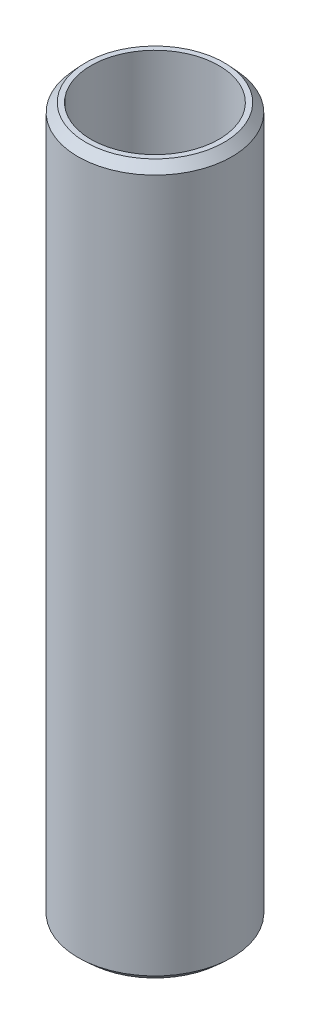
ISO-10303-21;
HEADER;
FILE_DESCRIPTION(('STEP AP214'),'2;1');
FILE_NAME('part.step','',(''),(''),'','','');
FILE_SCHEMA(('AUTOMOTIVE_DESIGN { 1 0 10303 214 1 1 1 1 }'));
ENDSEC;
DATA;
#1=APPLICATION_CONTEXT('core data for automotive mechanical design processes');
#2=APPLICATION_PROTOCOL_DEFINITION('international standard','automotive_design',2000,#1);
#3=PRODUCT_CONTEXT('',#1,'mechanical');
#4=PRODUCT('Part','Part','',(#3));
#5=PRODUCT_RELATED_PRODUCT_CATEGORY('part','',(#4));
#6=PRODUCT_DEFINITION_FORMATION('','',#4);
#7=PRODUCT_DEFINITION_CONTEXT('part definition',#1,'design');
#8=PRODUCT_DEFINITION('design','',#6,#7);
#9=PRODUCT_DEFINITION_SHAPE('','',#8);
#10=(LENGTH_UNIT() NAMED_UNIT(*) SI_UNIT(.MILLI.,.METRE.));
#11=(NAMED_UNIT(*) PLANE_ANGLE_UNIT() SI_UNIT($,.RADIAN.));
#12=(NAMED_UNIT(*) SI_UNIT($,.STERADIAN.) SOLID_ANGLE_UNIT());
#13=UNCERTAINTY_MEASURE_WITH_UNIT(LENGTH_MEASURE(1.E-05),#10,'distance_accuracy_value','');
#14=(GEOMETRIC_REPRESENTATION_CONTEXT(3) GLOBAL_UNCERTAINTY_ASSIGNED_CONTEXT((#13)) GLOBAL_UNIT_ASSIGNED_CONTEXT((#10,
#11,#12)) REPRESENTATION_CONTEXT('',''));
#15=CARTESIAN_POINT('',(0.,0.,0.));
#16=DIRECTION('',(0.,0.,1.));
#17=DIRECTION('',(1.,0.,0.));
#18=AXIS2_PLACEMENT_3D('',#15,#16,#17);
#19=CARTESIAN_POINT('',(0.,322.770922307598,0.));
#20=DIRECTION('',(0.,-1.,0.));
#21=DIRECTION('',(0.,0.,-1.));
#22=AXIS2_PLACEMENT_3D('',#19,#20,#21);
#23=CYLINDRICAL_SURFACE('',#22,35.);
#24=CARTESIAN_POINT('',(0.,318.893009212651,0.));
#25=DIRECTION('',(0.,1.,0.));
#26=DIRECTION('',(0.,0.,1.));
#27=AXIS2_PLACEMENT_3D('',#24,#25,#26);
#28=CIRCLE('',#27,35.);
#29=CARTESIAN_POINT('',(0.,318.893009212651,35.));
#30=VERTEX_POINT('',#29);
#31=EDGE_CURVE('E50',#30,#30,#28,.F.);
#32=ORIENTED_EDGE('',*,*,#31,.T.);
#33=EDGE_LOOP('',(#32));
#34=FACE_BOUND('',#33,.T.);
#35=CARTESIAN_POINT('',(0.,3.55687947888261,0.));
#36=DIRECTION('',(0.,1.,0.));
#37=DIRECTION('',(0.,0.,1.));
#38=AXIS2_PLACEMENT_3D('',#35,#36,#37);
#39=CIRCLE('',#38,35.);
#40=CARTESIAN_POINT('',(0.,3.55687947888261,35.));
#41=VERTEX_POINT('',#40);
#42=EDGE_CURVE('E51',#41,#41,#39,.T.);
#43=ORIENTED_EDGE('',*,*,#42,.T.);
#44=EDGE_LOOP('',(#43));
#45=FACE_BOUND('',#44,.T.);
#46=ADVANCED_FACE('F39',(#34,#45),#23,.T.);
#47=CARTESIAN_POINT('',(0.,322.770922307598,0.));
#48=DIRECTION('',(0.,1.,0.));
#49=DIRECTION('',(0.,0.,1.));
#50=AXIS2_PLACEMENT_3D('',#47,#48,#49);
#51=PLANE('',#50);
#52=CARTESIAN_POINT('',(0.,322.770922307598,0.));
#53=DIRECTION('',(0.,1.,0.));
#54=DIRECTION('',(0.,0.,1.));
#55=AXIS2_PLACEMENT_3D('',#52,#53,#54);
#56=CIRCLE('',#55,31.4431205211175);
#57=CARTESIAN_POINT('',(0.,322.770922307598,31.4431205211175));
#58=VERTEX_POINT('',#57);
#59=EDGE_CURVE('E54',#58,#58,#56,.T.);
#60=ORIENTED_EDGE('',*,*,#59,.T.);
#61=EDGE_LOOP('',(#60));
#62=FACE_BOUND('',#61,.T.);
#63=CARTESIAN_POINT('',(0.,322.770922307598,0.));
#64=DIRECTION('',(0.,1.,0.));
#65=DIRECTION('',(0.,0.,1.));
#66=AXIS2_PLACEMENT_3D('',#63,#64,#65);
#67=CIRCLE('',#66,29.0846264385908);
#68=CARTESIAN_POINT('',(0.,322.770922307598,29.0846264385908));
#69=VERTEX_POINT('',#68);
#70=EDGE_CURVE('E58',#69,#69,#67,.T.);
#71=ORIENTED_EDGE('',*,*,#70,.F.);
#72=EDGE_LOOP('',(#71));
#73=FACE_BOUND('',#72,.T.);
#74=ADVANCED_FACE('F69',(#62,#73),#51,.T.);
#75=CARTESIAN_POINT('',(0.,0.,0.));
#76=DIRECTION('',(0.,1.,0.));
#77=DIRECTION('',(0.,0.,1.));
#78=AXIS2_PLACEMENT_3D('',#75,#76,#77);
#79=PLANE('',#78);
#80=CARTESIAN_POINT('',(0.,0.,0.));
#81=DIRECTION('',(0.,1.,0.));
#82=DIRECTION('',(0.,0.,1.));
#83=AXIS2_PLACEMENT_3D('',#80,#81,#82);
#84=CIRCLE('',#83,31.1220869050524);
#85=CARTESIAN_POINT('',(0.,0.,31.1220869050524));
#86=VERTEX_POINT('',#85);
#87=EDGE_CURVE('E10',#86,#86,#84,.F.);
#88=ORIENTED_EDGE('',*,*,#87,.T.);
#89=EDGE_LOOP('',(#88));
#90=FACE_BOUND('',#89,.T.);
#91=CARTESIAN_POINT('',(0.,0.,0.));
#92=DIRECTION('',(0.,1.,0.));
#93=DIRECTION('',(0.,0.,1.));
#94=AXIS2_PLACEMENT_3D('',#91,#92,#93);
#95=CIRCLE('',#94,29.0846264385908);
#96=CARTESIAN_POINT('',(0.,0.,29.0846264385908));
#97=VERTEX_POINT('',#96);
#98=EDGE_CURVE('E63',#97,#97,#95,.T.);
#99=ORIENTED_EDGE('',*,*,#98,.T.);
#100=EDGE_LOOP('',(#99));
#101=FACE_BOUND('',#100,.T.);
#102=ADVANCED_FACE('F75',(#90,#101),#79,.F.);
#103=CARTESIAN_POINT('',(0.,322.770922307598,0.));
#104=DIRECTION('',(0.,-1.,0.));
#105=DIRECTION('',(0.,0.,-1.));
#106=AXIS2_PLACEMENT_3D('',#103,#104,#105);
#107=CYLINDRICAL_SURFACE('',#106,29.0846264385908);
#108=ORIENTED_EDGE('',*,*,#70,.T.);
#109=EDGE_LOOP('',(#108));
#110=FACE_BOUND('',#109,.T.);
#111=ORIENTED_EDGE('',*,*,#98,.F.);
#112=EDGE_LOOP('',(#111));
#113=FACE_BOUND('',#112,.T.);
#114=ADVANCED_FACE('F70',(#110,#113),#107,.F.);
#115=CARTESIAN_POINT('',(0.,322.770922307598,0.));
#116=DIRECTION('',(0.,-1.,0.));
#117=DIRECTION('',(0.,0.,-1.));
#118=AXIS2_PLACEMENT_3D('',#115,#116,#117);
#119=CONICAL_SURFACE('',#118,31.4431205211175,0.742245067601773);
#120=ORIENTED_EDGE('',*,*,#31,.F.);
#121=EDGE_LOOP('',(#120));
#122=FACE_BOUND('',#121,.T.);
#123=ORIENTED_EDGE('',*,*,#59,.F.);
#124=EDGE_LOOP('',(#123));
#125=FACE_BOUND('',#124,.T.);
#126=ADVANCED_FACE('F81',(#122,#125),#119,.T.);
#127=CARTESIAN_POINT('',(0.,3.55687947888261,0.));
#128=DIRECTION('',(0.,1.,0.));
#129=DIRECTION('',(0.,0.,1.));
#130=AXIS2_PLACEMENT_3D('',#127,#128,#129);
#131=CONICAL_SURFACE('',#130,35.,0.828551259193121);
#132=ORIENTED_EDGE('',*,*,#87,.F.);
#133=EDGE_LOOP('',(#132));
#134=FACE_BOUND('',#133,.T.);
#135=ORIENTED_EDGE('',*,*,#42,.F.);
#136=EDGE_LOOP('',(#135));
#137=FACE_BOUND('',#136,.T.);
#138=ADVANCED_FACE('F45',(#134,#137),#131,.T.);
#139=CLOSED_SHELL('',(#46,#74,#102,#114,#126,#138));
#140=MANIFOLD_SOLID_BREP('B2',#139);
#141=ADVANCED_BREP_SHAPE_REPRESENTATION('',(#18,#140),#14);
#142=SHAPE_DEFINITION_REPRESENTATION(#9,#141);
ENDSEC;
END-ISO-10303-21;
